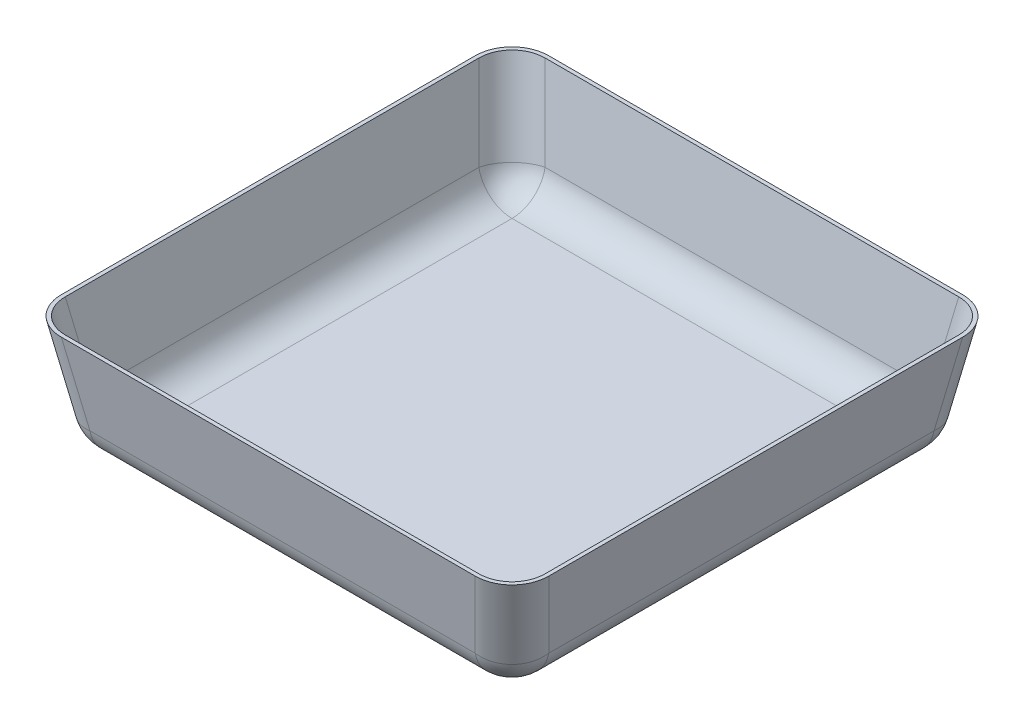
ISO-10303-21;
HEADER;
FILE_DESCRIPTION(('STEP AP214'),'2;1');
FILE_NAME('part.step','',(''),(''),'','','');
FILE_SCHEMA(('AUTOMOTIVE_DESIGN { 1 0 10303 214 1 1 1 1 }'));
ENDSEC;
DATA;
#1=APPLICATION_CONTEXT('core data for automotive mechanical design processes');
#2=APPLICATION_PROTOCOL_DEFINITION('international standard','automotive_design',2000,#1);
#3=PRODUCT_CONTEXT('',#1,'mechanical');
#4=PRODUCT('Part','Part','',(#3));
#5=PRODUCT_RELATED_PRODUCT_CATEGORY('part','',(#4));
#6=PRODUCT_DEFINITION_FORMATION('','',#4);
#7=PRODUCT_DEFINITION_CONTEXT('part definition',#1,'design');
#8=PRODUCT_DEFINITION('design','',#6,#7);
#9=PRODUCT_DEFINITION_SHAPE('','',#8);
#10=(LENGTH_UNIT() NAMED_UNIT(*) SI_UNIT(.MILLI.,.METRE.));
#11=(NAMED_UNIT(*) PLANE_ANGLE_UNIT() SI_UNIT($,.RADIAN.));
#12=(NAMED_UNIT(*) SI_UNIT($,.STERADIAN.) SOLID_ANGLE_UNIT());
#13=UNCERTAINTY_MEASURE_WITH_UNIT(LENGTH_MEASURE(1.E-05),#10,'distance_accuracy_value','');
#14=(GEOMETRIC_REPRESENTATION_CONTEXT(3) GLOBAL_UNCERTAINTY_ASSIGNED_CONTEXT((#13)) GLOBAL_UNIT_ASSIGNED_CONTEXT((#10,
#11,#12)) REPRESENTATION_CONTEXT('',''));
#15=CARTESIAN_POINT('',(0.,0.,0.));
#16=DIRECTION('',(0.,0.,1.));
#17=DIRECTION('',(1.,0.,0.));
#18=AXIS2_PLACEMENT_3D('',#15,#16,#17);
#19=CARTESIAN_POINT('',(152.4,0.,-152.4));
#20=DIRECTION('',(0.984807753012208,-0.173648177666931,0.));
#21=DIRECTION('',(0.173648177666931,0.984807753012208,0.));
#22=AXIS2_PLACEMENT_3D('',#19,#20,#21);
#23=PLANE('',#22);
#24=DIRECTION('',(0.,0.,1.));
#25=VECTOR('',#24,1.);
#26=CARTESIAN_POINT('',(165.836115929985,76.2,-152.4));
#27=LINE('',#26,#25);
#28=CARTESIAN_POINT('',(165.836115929985,76.2,140.821999003475));
#29=VERTEX_POINT('',#28);
#30=CARTESIAN_POINT('',(165.836115929985,76.2,-140.821999003475));
#31=VERTEX_POINT('',#30);
#32=EDGE_CURVE('E277',#29,#31,#27,.F.);
#33=ORIENTED_EDGE('',*,*,#32,.F.);
#34=DIRECTION('',(0.171087869746036,0.970287525247814,0.171087869746036));
#35=VECTOR('',#34,1.);
#36=CARTESIAN_POINT('',(144.21037086044,-46.4456948485988,119.19625393393));
#37=LINE('',#36,#35);
#38=CARTESIAN_POINT('',(156.100986294607,20.98933628726,131.086869368097));
#39=VERTEX_POINT('',#38);
#40=EDGE_CURVE('E57',#29,#39,#37,.F.);
#41=ORIENTED_EDGE('',*,*,#40,.T.);
#42=DIRECTION('',(0.,0.,-1.));
#43=VECTOR('',#42,1.);
#44=CARTESIAN_POINT('',(156.100986294607,20.98933628726,-152.4));
#45=LINE('',#44,#43);
#46=CARTESIAN_POINT('',(156.100986294607,20.98933628726,-131.086869368097));
#47=VERTEX_POINT('',#46);
#48=EDGE_CURVE('E319',#39,#47,#45,.T.);
#49=ORIENTED_EDGE('',*,*,#48,.T.);
#50=DIRECTION('',(0.171087869746036,0.970287525247814,-0.171087869746036));
#51=VECTOR('',#50,1.);
#52=CARTESIAN_POINT('',(153.132189696747,4.1524541156735,-128.118072770237));
#53=LINE('',#52,#51);
#54=EDGE_CURVE('E317',#47,#31,#53,.T.);
#55=ORIENTED_EDGE('',*,*,#54,.T.);
#56=EDGE_LOOP('',(#33,#41,#49,#55));
#57=FACE_BOUND('',#56,.T.);
#58=ADVANCED_FACE('F32',(#57),#23,.T.);
#59=CARTESIAN_POINT('',(-152.4,0.,-152.4));
#60=DIRECTION('',(0.,-0.173648177666931,-0.984807753012208));
#61=DIRECTION('',(0.,0.984807753012208,-0.173648177666931));
#62=AXIS2_PLACEMENT_3D('',#59,#60,#61);
#63=PLANE('',#62);
#64=DIRECTION('',(-1.,0.,0.));
#65=VECTOR('',#64,1.);
#66=CARTESIAN_POINT('',(-152.4,20.98933628726,-156.100986294607));
#67=LINE('',#66,#65);
#68=CARTESIAN_POINT('',(131.086869368097,20.98933628726,-156.100986294607));
#69=VERTEX_POINT('',#68);
#70=CARTESIAN_POINT('',(-131.086869368097,20.98933628726,-156.100986294607));
#71=VERTEX_POINT('',#70);
#72=EDGE_CURVE('E291',#69,#71,#67,.T.);
#73=ORIENTED_EDGE('',*,*,#72,.T.);
#74=DIRECTION('',(-0.171087869746036,0.970287525247814,-0.171087869746036));
#75=VECTOR('',#74,1.);
#76=CARTESIAN_POINT('',(-128.118072770237,4.1524541156735,-153.132189696747));
#77=LINE('',#76,#75);
#78=CARTESIAN_POINT('',(-140.821999003475,76.2,-165.836115929985));
#79=VERTEX_POINT('',#78);
#80=EDGE_CURVE('E294',#71,#79,#77,.T.);
#81=ORIENTED_EDGE('',*,*,#80,.T.);
#82=DIRECTION('',(1.,0.,0.));
#83=VECTOR('',#82,1.);
#84=CARTESIAN_POINT('',(-152.4,76.2,-165.836115929985));
#85=LINE('',#84,#83);
#86=CARTESIAN_POINT('',(140.821999003475,76.2,-165.836115929985));
#87=VERTEX_POINT('',#86);
#88=EDGE_CURVE('E280',#87,#79,#85,.F.);
#89=ORIENTED_EDGE('',*,*,#88,.F.);
#90=DIRECTION('',(0.171087869746036,0.970287525247814,-0.171087869746036));
#91=VECTOR('',#90,1.);
#92=CARTESIAN_POINT('',(119.19625393393,-46.4456948485988,-144.21037086044));
#93=LINE('',#92,#91);
#94=EDGE_CURVE('E289',#87,#69,#93,.F.);
#95=ORIENTED_EDGE('',*,*,#94,.T.);
#96=EDGE_LOOP('',(#73,#81,#89,#95));
#97=FACE_BOUND('',#96,.T.);
#98=ADVANCED_FACE('F380',(#97),#63,.T.);
#99=CARTESIAN_POINT('',(-152.4,0.,-152.4));
#100=DIRECTION('',(-0.984807753012208,-0.173648177666931,0.));
#101=DIRECTION('',(0.173648177666931,-0.984807753012208,0.));
#102=AXIS2_PLACEMENT_3D('',#99,#100,#101);
#103=PLANE('',#102);
#104=DIRECTION('',(0.,0.,1.));
#105=VECTOR('',#104,1.);
#106=CARTESIAN_POINT('',(-156.100986294607,20.98933628726,-152.4));
#107=LINE('',#106,#105);
#108=CARTESIAN_POINT('',(-156.100986294607,20.98933628726,-131.086869368097));
#109=VERTEX_POINT('',#108);
#110=CARTESIAN_POINT('',(-156.100986294607,20.98933628726,131.086869368097));
#111=VERTEX_POINT('',#110);
#112=EDGE_CURVE('E307',#109,#111,#107,.T.);
#113=ORIENTED_EDGE('',*,*,#112,.T.);
#114=DIRECTION('',(-0.171087869746036,0.970287525247814,0.171087869746036));
#115=VECTOR('',#114,1.);
#116=CARTESIAN_POINT('',(-144.21037086044,-46.4456948485988,119.19625393393));
#117=LINE('',#116,#115);
#118=CARTESIAN_POINT('',(-165.836115929985,76.2,140.821999003475));
#119=VERTEX_POINT('',#118);
#120=EDGE_CURVE('E309',#111,#119,#117,.T.);
#121=ORIENTED_EDGE('',*,*,#120,.T.);
#122=DIRECTION('',(0.,0.,-1.));
#123=VECTOR('',#122,1.);
#124=CARTESIAN_POINT('',(-165.836115929985,76.2,-152.4));
#125=LINE('',#124,#123);
#126=CARTESIAN_POINT('',(-165.836115929985,76.2,-140.821999003475));
#127=VERTEX_POINT('',#126);
#128=EDGE_CURVE('E283',#127,#119,#125,.F.);
#129=ORIENTED_EDGE('',*,*,#128,.F.);
#130=DIRECTION('',(-0.171087869746036,0.970287525247814,-0.171087869746036));
#131=VECTOR('',#130,1.);
#132=CARTESIAN_POINT('',(-153.132189696747,4.1524541156735,-128.118072770237));
#133=LINE('',#132,#131);
#134=EDGE_CURVE('E305',#127,#109,#133,.F.);
#135=ORIENTED_EDGE('',*,*,#134,.T.);
#136=EDGE_LOOP('',(#113,#121,#129,#135));
#137=FACE_BOUND('',#136,.T.);
#138=ADVANCED_FACE('F390',(#137),#103,.T.);
#139=CARTESIAN_POINT('',(-152.4,0.,152.4));
#140=DIRECTION('',(0.,-0.173648177666931,0.984807753012208));
#141=DIRECTION('',(0.,-0.984807753012208,-0.173648177666931));
#142=AXIS2_PLACEMENT_3D('',#139,#140,#141);
#143=PLANE('',#142);
#144=DIRECTION('',(-1.,0.,0.));
#145=VECTOR('',#144,1.);
#146=CARTESIAN_POINT('',(-152.4,76.2,165.836115929985));
#147=LINE('',#146,#145);
#148=CARTESIAN_POINT('',(-140.821999003475,76.2,165.836115929985));
#149=VERTEX_POINT('',#148);
#150=CARTESIAN_POINT('',(140.821999003475,76.2,165.836115929985));
#151=VERTEX_POINT('',#150);
#152=EDGE_CURVE('E286',#149,#151,#147,.F.);
#153=ORIENTED_EDGE('',*,*,#152,.F.);
#154=DIRECTION('',(-0.171087869746036,0.970287525247814,0.171087869746036));
#155=VECTOR('',#154,1.);
#156=CARTESIAN_POINT('',(-128.118072770237,4.15245411567349,153.132189696747));
#157=LINE('',#156,#155);
#158=CARTESIAN_POINT('',(-131.086869368097,20.98933628726,156.100986294607));
#159=VERTEX_POINT('',#158);
#160=EDGE_CURVE('E315',#149,#159,#157,.F.);
#161=ORIENTED_EDGE('',*,*,#160,.T.);
#162=DIRECTION('',(1.,0.,0.));
#163=VECTOR('',#162,1.);
#164=CARTESIAN_POINT('',(-152.4,20.98933628726,156.100986294607));
#165=LINE('',#164,#163);
#166=CARTESIAN_POINT('',(131.086869368097,20.98933628726,156.100986294607));
#167=VERTEX_POINT('',#166);
#168=EDGE_CURVE('E313',#159,#167,#165,.T.);
#169=ORIENTED_EDGE('',*,*,#168,.T.);
#170=DIRECTION('',(0.171087869746036,0.970287525247814,0.171087869746036));
#171=VECTOR('',#170,1.);
#172=CARTESIAN_POINT('',(119.19625393393,-46.4456948485988,144.21037086044));
#173=LINE('',#172,#171);
#174=EDGE_CURVE('E311',#167,#151,#173,.T.);
#175=ORIENTED_EDGE('',*,*,#174,.T.);
#176=EDGE_LOOP('',(#153,#161,#169,#175));
#177=FACE_BOUND('',#176,.T.);
#178=ADVANCED_FACE('F412',(#177),#143,.T.);
#179=CARTESIAN_POINT('',(0.,76.2,0.));
#180=DIRECTION('',(0.,1.,0.));
#181=DIRECTION('',(0.,0.,1.));
#182=AXIS2_PLACEMENT_3D('',#179,#180,#181);
#183=PLANE('',#182);
#184=DIRECTION('',(0.,0.,-1.));
#185=VECTOR('',#184,1.);
#186=CARTESIAN_POINT('',(-163.256932335795,76.2,-152.4));
#187=LINE('',#186,#185);
#188=CARTESIAN_POINT('',(-163.256932335795,76.2,-140.744227101936));
#189=VERTEX_POINT('',#188);
#190=CARTESIAN_POINT('',(-163.256932335795,76.2,140.744227101936));
#191=VERTEX_POINT('',#190);
#192=EDGE_CURVE('E266',#189,#191,#187,.F.);
#193=ORIENTED_EDGE('',*,*,#192,.F.);
#194=CARTESIAN_POINT('',(-140.044279988087,76.2,-140.044279988087));
#195=DIRECTION('',(0.,1.,0.));
#196=DIRECTION('',(0.707106781186548,0.,0.707106781186547));
#197=AXIS2_PLACEMENT_3D('',#194,#195,#196);
#198=ELLIPSE('',#197,23.5600266984382,22.86);
#199=CARTESIAN_POINT('',(-140.744227101936,76.2,-163.256932335795));
#200=VERTEX_POINT('',#199);
#201=EDGE_CURVE('E267',#200,#189,#198,.T.);
#202=ORIENTED_EDGE('',*,*,#201,.F.);
#203=DIRECTION('',(1.,0.,0.));
#204=VECTOR('',#203,1.);
#205=CARTESIAN_POINT('',(-152.4,76.2,-163.256932335795));
#206=LINE('',#205,#204);
#207=CARTESIAN_POINT('',(140.744227101936,76.2,-163.256932335795));
#208=VERTEX_POINT('',#207);
#209=EDGE_CURVE('E49',#208,#200,#206,.F.);
#210=ORIENTED_EDGE('',*,*,#209,.F.);
#211=CARTESIAN_POINT('',(140.044279988087,76.2,-140.044279988087));
#212=DIRECTION('',(0.,1.,0.));
#213=DIRECTION('',(-0.707106781186547,0.,0.707106781186548));
#214=AXIS2_PLACEMENT_3D('',#211,#212,#213);
#215=ELLIPSE('',#214,23.5600266984382,22.86);
#216=CARTESIAN_POINT('',(163.256932335795,76.2,-140.744227101936));
#217=VERTEX_POINT('',#216);
#218=EDGE_CURVE('E183',#217,#208,#215,.T.);
#219=ORIENTED_EDGE('',*,*,#218,.F.);
#220=DIRECTION('',(0.,0.,1.));
#221=VECTOR('',#220,1.);
#222=CARTESIAN_POINT('',(163.256932335795,76.2,-152.4));
#223=LINE('',#222,#221);
#224=CARTESIAN_POINT('',(163.256932335795,76.2,140.744227101936));
#225=VERTEX_POINT('',#224);
#226=EDGE_CURVE('E240',#225,#217,#223,.F.);
#227=ORIENTED_EDGE('',*,*,#226,.F.);
#228=CARTESIAN_POINT('',(140.044279988087,76.2,140.044279988087));
#229=DIRECTION('',(0.,1.,0.));
#230=DIRECTION('',(-0.707106781186547,0.,-0.707106781186548));
#231=AXIS2_PLACEMENT_3D('',#228,#229,#230);
#232=ELLIPSE('',#231,23.5600266984382,22.86);
#233=CARTESIAN_POINT('',(140.744227101936,76.2,163.256932335795));
#234=VERTEX_POINT('',#233);
#235=EDGE_CURVE('E178',#234,#225,#232,.T.);
#236=ORIENTED_EDGE('',*,*,#235,.F.);
#237=DIRECTION('',(-1.,0.,0.));
#238=VECTOR('',#237,1.);
#239=CARTESIAN_POINT('',(-152.4,76.2,163.256932335795));
#240=LINE('',#239,#238);
#241=CARTESIAN_POINT('',(-140.744227101936,76.2,163.256932335795));
#242=VERTEX_POINT('',#241);
#243=EDGE_CURVE('E250',#242,#234,#240,.F.);
#244=ORIENTED_EDGE('',*,*,#243,.F.);
#245=CARTESIAN_POINT('',(-140.044279988087,76.2,140.044279988087));
#246=DIRECTION('',(0.,1.,0.));
#247=DIRECTION('',(0.707106781186548,0.,-0.707106781186547));
#248=AXIS2_PLACEMENT_3D('',#245,#246,#247);
#249=ELLIPSE('',#248,23.5600266984382,22.86);
#250=EDGE_CURVE('E269',#191,#242,#249,.T.);
#251=ORIENTED_EDGE('',*,*,#250,.F.);
#252=EDGE_LOOP('',(#193,#202,#210,#219,#227,#236,#244,#251));
#253=FACE_BOUND('',#252,.T.);
#254=ORIENTED_EDGE('',*,*,#128,.T.);
#255=CARTESIAN_POINT('',(-140.044279988087,76.2,140.044279988087));
#256=DIRECTION('',(0.,1.,0.));
#257=DIRECTION('',(0.707106781186548,0.,-0.707106781186547));
#258=AXIS2_PLACEMENT_3D('',#255,#256,#257);
#259=ELLIPSE('',#258,26.1778074427091,25.4);
#260=EDGE_CURVE('E11',#119,#149,#259,.T.);
#261=ORIENTED_EDGE('',*,*,#260,.T.);
#262=ORIENTED_EDGE('',*,*,#152,.T.);
#263=CARTESIAN_POINT('',(140.044279988087,76.2,140.044279988087));
#264=DIRECTION('',(0.,1.,0.));
#265=DIRECTION('',(-0.707106781186547,0.,-0.707106781186548));
#266=AXIS2_PLACEMENT_3D('',#263,#264,#265);
#267=ELLIPSE('',#266,26.1778074427091,25.4);
#268=EDGE_CURVE('E324',#151,#29,#267,.T.);
#269=ORIENTED_EDGE('',*,*,#268,.T.);
#270=ORIENTED_EDGE('',*,*,#32,.T.);
#271=CARTESIAN_POINT('',(140.044279988087,76.2,-140.044279988087));
#272=DIRECTION('',(0.,1.,0.));
#273=DIRECTION('',(-0.707106781186547,0.,0.707106781186548));
#274=AXIS2_PLACEMENT_3D('',#271,#272,#273);
#275=ELLIPSE('',#274,26.1778074427091,25.4);
#276=EDGE_CURVE('E322',#31,#87,#275,.T.);
#277=ORIENTED_EDGE('',*,*,#276,.T.);
#278=ORIENTED_EDGE('',*,*,#88,.T.);
#279=CARTESIAN_POINT('',(-140.044279988087,76.2,-140.044279988087));
#280=DIRECTION('',(0.,1.,0.));
#281=DIRECTION('',(0.707106781186548,0.,0.707106781186547));
#282=AXIS2_PLACEMENT_3D('',#279,#280,#281);
#283=ELLIPSE('',#282,26.1778074427091,25.4);
#284=EDGE_CURVE('E41',#79,#127,#283,.T.);
#285=ORIENTED_EDGE('',*,*,#284,.T.);
#286=EDGE_LOOP('',(#254,#261,#262,#269,#270,#277,#278,#285));
#287=FACE_BOUND('',#286,.T.);
#288=ADVANCED_FACE('F377',(#253,#287),#183,.T.);
#289=CARTESIAN_POINT('',(0.,0.,0.));
#290=DIRECTION('',(0.,1.,0.));
#291=DIRECTION('',(0.,0.,1.));
#292=AXIS2_PLACEMENT_3D('',#289,#290,#291);
#293=PLANE('',#292);
#294=DIRECTION('',(0.,0.,-1.));
#295=VECTOR('',#294,1.);
#296=CARTESIAN_POINT('',(-131.086869368097,0.,0.));
#297=LINE('',#296,#295);
#298=CARTESIAN_POINT('',(-131.086869368097,0.,131.086869368097));
#299=VERTEX_POINT('',#298);
#300=CARTESIAN_POINT('',(-131.086869368097,0.,-131.086869368097));
#301=VERTEX_POINT('',#300);
#302=EDGE_CURVE('E300',#299,#301,#297,.T.);
#303=ORIENTED_EDGE('',*,*,#302,.T.);
#304=DIRECTION('',(1.,0.,0.));
#305=VECTOR('',#304,1.);
#306=CARTESIAN_POINT('',(0.,0.,-131.086869368097));
#307=LINE('',#306,#305);
#308=CARTESIAN_POINT('',(131.086869368097,0.,-131.086869368097));
#309=VERTEX_POINT('',#308);
#310=EDGE_CURVE('E302',#301,#309,#307,.T.);
#311=ORIENTED_EDGE('',*,*,#310,.T.);
#312=DIRECTION('',(0.,0.,1.));
#313=VECTOR('',#312,1.);
#314=CARTESIAN_POINT('',(131.086869368097,0.,0.));
#315=LINE('',#314,#313);
#316=CARTESIAN_POINT('',(131.086869368097,0.,131.086869368097));
#317=VERTEX_POINT('',#316);
#318=EDGE_CURVE('E296',#309,#317,#315,.T.);
#319=ORIENTED_EDGE('',*,*,#318,.T.);
#320=DIRECTION('',(-1.,0.,0.));
#321=VECTOR('',#320,1.);
#322=CARTESIAN_POINT('',(0.,0.,131.086869368097));
#323=LINE('',#322,#321);
#324=EDGE_CURVE('E298',#317,#299,#323,.T.);
#325=ORIENTED_EDGE('',*,*,#324,.T.);
#326=EDGE_LOOP('',(#303,#311,#319,#325));
#327=FACE_BOUND('',#326,.T.);
#328=ADVANCED_FACE('F407',(#327),#293,.F.);
#329=CARTESIAN_POINT('',(119.19625393393,-42.0350311358588,119.19625393393));
#330=DIRECTION('',(-0.171087869746036,-0.970287525247814,-0.171087869746036));
#331=DIRECTION('',(0.,0.173648177666931,-0.984807753012208));
#332=AXIS2_PLACEMENT_3D('',#329,#330,#331);
#333=CYLINDRICAL_SURFACE('',#332,25.4);
#334=ORIENTED_EDGE('',*,*,#268,.F.);
#335=ORIENTED_EDGE('',*,*,#174,.F.);
#336=CARTESIAN_POINT('',(131.086869368097,25.4,131.086869368097));
#337=DIRECTION('',(-0.171087869746036,-0.970287525247814,-0.171087869746036));
#338=DIRECTION('',(0.,0.173648177666931,-0.984807753012208));
#339=AXIS2_PLACEMENT_3D('',#336,#337,#338);
#340=CIRCLE('',#339,25.4);
#341=EDGE_CURVE('E353',#39,#167,#340,.T.);
#342=ORIENTED_EDGE('',*,*,#341,.F.);
#343=ORIENTED_EDGE('',*,*,#40,.F.);
#344=EDGE_LOOP('',(#334,#335,#342,#343));
#345=FACE_BOUND('',#344,.T.);
#346=ADVANCED_FACE('F34',(#345),#333,.T.);
#347=CARTESIAN_POINT('',(-128.118072770237,8.56311782841353,128.118072770237));
#348=DIRECTION('',(0.171087869746036,-0.970287525247814,-0.171087869746036));
#349=DIRECTION('',(0.984807753012208,0.173648177666931,0.));
#350=AXIS2_PLACEMENT_3D('',#347,#348,#349);
#351=CYLINDRICAL_SURFACE('',#350,25.4);
#352=ORIENTED_EDGE('',*,*,#260,.F.);
#353=ORIENTED_EDGE('',*,*,#120,.F.);
#354=CARTESIAN_POINT('',(-131.086869368097,25.4,131.086869368097));
#355=DIRECTION('',(0.171087869746036,-0.970287525247814,-0.171087869746036));
#356=DIRECTION('',(0.984807753012208,0.173648177666931,0.));
#357=AXIS2_PLACEMENT_3D('',#354,#355,#356);
#358=CIRCLE('',#357,25.4);
#359=EDGE_CURVE('E351',#159,#111,#358,.T.);
#360=ORIENTED_EDGE('',*,*,#359,.F.);
#361=ORIENTED_EDGE('',*,*,#160,.F.);
#362=EDGE_LOOP('',(#352,#353,#360,#361));
#363=FACE_BOUND('',#362,.T.);
#364=ADVANCED_FACE('F395',(#363),#351,.T.);
#365=CARTESIAN_POINT('',(-152.4,25.4,131.086869368097));
#366=DIRECTION('',(-1.,0.,0.));
#367=DIRECTION('',(0.,0.,1.));
#368=AXIS2_PLACEMENT_3D('',#365,#366,#367);
#369=CYLINDRICAL_SURFACE('',#368,25.4);
#370=CARTESIAN_POINT('',(131.086869368097,25.4,131.086869368097));
#371=DIRECTION('',(1.,0.,0.));
#372=DIRECTION('',(0.,0.,-1.));
#373=AXIS2_PLACEMENT_3D('',#370,#371,#372);
#374=CIRCLE('',#373,25.4);
#375=EDGE_CURVE('E36',#167,#317,#374,.T.);
#376=ORIENTED_EDGE('',*,*,#375,.F.);
#377=ORIENTED_EDGE('',*,*,#168,.F.);
#378=CARTESIAN_POINT('',(-131.086869368097,25.4,131.086869368097));
#379=DIRECTION('',(-1.,0.,0.));
#380=DIRECTION('',(0.,0.,1.));
#381=AXIS2_PLACEMENT_3D('',#378,#379,#380);
#382=CIRCLE('',#381,25.4);
#383=EDGE_CURVE('E348',#299,#159,#382,.T.);
#384=ORIENTED_EDGE('',*,*,#383,.F.);
#385=ORIENTED_EDGE('',*,*,#324,.F.);
#386=EDGE_LOOP('',(#376,#377,#384,#385));
#387=FACE_BOUND('',#386,.T.);
#388=ADVANCED_FACE('F408',(#387),#369,.T.);
#389=CARTESIAN_POINT('',(131.086869368097,25.4,131.086869368097));
#390=DIRECTION('',(0.,0.,1.));
#391=DIRECTION('',(1.,0.,0.));
#392=AXIS2_PLACEMENT_3D('',#389,#390,#391);
#393=SPHERICAL_SURFACE('',#392,25.4);
#394=ORIENTED_EDGE('',*,*,#341,.T.);
#395=ORIENTED_EDGE('',*,*,#375,.T.);
#396=CARTESIAN_POINT('',(131.086869368097,25.4,131.086869368097));
#397=DIRECTION('',(0.,0.,1.));
#398=DIRECTION('',(1.,0.,0.));
#399=AXIS2_PLACEMENT_3D('',#396,#397,#398);
#400=CIRCLE('',#399,25.4);
#401=EDGE_CURVE('E345',#39,#317,#400,.F.);
#402=ORIENTED_EDGE('',*,*,#401,.F.);
#403=EDGE_LOOP('',(#394,#395,#402));
#404=FACE_BOUND('',#403,.T.);
#405=ADVANCED_FACE('F359',(#404),#393,.T.);
#406=CARTESIAN_POINT('',(-131.086869368097,25.4,131.086869368097));
#407=DIRECTION('',(0.,0.,1.));
#408=DIRECTION('',(1.,0.,0.));
#409=AXIS2_PLACEMENT_3D('',#406,#407,#408);
#410=SPHERICAL_SURFACE('',#409,25.4);
#411=ORIENTED_EDGE('',*,*,#383,.T.);
#412=ORIENTED_EDGE('',*,*,#359,.T.);
#413=CARTESIAN_POINT('',(-131.086869368097,25.4,131.086869368097));
#414=DIRECTION('',(0.,0.,1.));
#415=DIRECTION('',(1.,0.,0.));
#416=AXIS2_PLACEMENT_3D('',#413,#414,#415);
#417=CIRCLE('',#416,25.4);
#418=EDGE_CURVE('E342',#299,#111,#417,.F.);
#419=ORIENTED_EDGE('',*,*,#418,.F.);
#420=EDGE_LOOP('',(#411,#412,#419));
#421=FACE_BOUND('',#420,.T.);
#422=ADVANCED_FACE('F399',(#421),#410,.T.);
#423=CARTESIAN_POINT('',(131.086869368097,25.4,-152.4));
#424=DIRECTION('',(0.,0.,1.));
#425=DIRECTION('',(1.,0.,0.));
#426=AXIS2_PLACEMENT_3D('',#423,#424,#425);
#427=CYLINDRICAL_SURFACE('',#426,25.4);
#428=ORIENTED_EDGE('',*,*,#401,.T.);
#429=ORIENTED_EDGE('',*,*,#318,.F.);
#430=CARTESIAN_POINT('',(131.086869368097,25.4,-131.086869368097));
#431=DIRECTION('',(0.,0.,-1.));
#432=DIRECTION('',(-1.,0.,0.));
#433=AXIS2_PLACEMENT_3D('',#430,#431,#432);
#434=CIRCLE('',#433,25.4);
#435=EDGE_CURVE('E339',#47,#309,#434,.T.);
#436=ORIENTED_EDGE('',*,*,#435,.F.);
#437=ORIENTED_EDGE('',*,*,#48,.F.);
#438=EDGE_LOOP('',(#428,#429,#436,#437));
#439=FACE_BOUND('',#438,.T.);
#440=ADVANCED_FACE('F366',(#439),#427,.T.);
#441=CARTESIAN_POINT('',(119.19625393393,-42.0350311358588,-119.19625393393));
#442=DIRECTION('',(-0.171087869746036,-0.970287525247814,0.171087869746036));
#443=DIRECTION('',(0.,-0.173648177666931,-0.984807753012208));
#444=AXIS2_PLACEMENT_3D('',#441,#442,#443);
#445=CYLINDRICAL_SURFACE('',#444,25.4);
#446=ORIENTED_EDGE('',*,*,#276,.F.);
#447=ORIENTED_EDGE('',*,*,#54,.F.);
#448=CARTESIAN_POINT('',(131.086869368097,25.4,-131.086869368097));
#449=DIRECTION('',(-0.171087869746036,-0.970287525247814,0.171087869746036));
#450=DIRECTION('',(0.984807753012208,-0.173648177666931,0.));
#451=AXIS2_PLACEMENT_3D('',#448,#449,#450);
#452=CIRCLE('',#451,25.4);
#453=EDGE_CURVE('E336',#69,#47,#452,.T.);
#454=ORIENTED_EDGE('',*,*,#453,.F.);
#455=ORIENTED_EDGE('',*,*,#94,.F.);
#456=EDGE_LOOP('',(#446,#447,#454,#455));
#457=FACE_BOUND('',#456,.T.);
#458=ADVANCED_FACE('F372',(#457),#445,.T.);
#459=CARTESIAN_POINT('',(-128.118072770237,8.56311782841354,-128.118072770237));
#460=DIRECTION('',(0.171087869746036,-0.970287525247814,0.171087869746036));
#461=DIRECTION('',(0.984807753012208,0.173648177666931,0.));
#462=AXIS2_PLACEMENT_3D('',#459,#460,#461);
#463=CYLINDRICAL_SURFACE('',#462,25.4);
#464=ORIENTED_EDGE('',*,*,#284,.F.);
#465=ORIENTED_EDGE('',*,*,#80,.F.);
#466=CARTESIAN_POINT('',(-131.086869368097,25.4,-131.086869368097));
#467=DIRECTION('',(0.171087869746036,-0.970287525247814,0.171087869746035));
#468=DIRECTION('',(0.984807753012208,0.173648177666931,0.));
#469=AXIS2_PLACEMENT_3D('',#466,#467,#468);
#470=CIRCLE('',#469,25.4);
#471=EDGE_CURVE('E333',#109,#71,#470,.T.);
#472=ORIENTED_EDGE('',*,*,#471,.F.);
#473=ORIENTED_EDGE('',*,*,#134,.F.);
#474=EDGE_LOOP('',(#464,#465,#472,#473));
#475=FACE_BOUND('',#474,.T.);
#476=ADVANCED_FACE('F385',(#475),#463,.T.);
#477=CARTESIAN_POINT('',(-131.086869368097,25.4,-152.4));
#478=DIRECTION('',(0.,0.,-1.));
#479=DIRECTION('',(-1.,0.,0.));
#480=AXIS2_PLACEMENT_3D('',#477,#478,#479);
#481=CYLINDRICAL_SURFACE('',#480,25.4);
#482=ORIENTED_EDGE('',*,*,#418,.T.);
#483=ORIENTED_EDGE('',*,*,#112,.F.);
#484=CARTESIAN_POINT('',(-131.086869368097,25.4,-131.086869368097));
#485=DIRECTION('',(0.,0.,-1.));
#486=DIRECTION('',(-1.,0.,0.));
#487=AXIS2_PLACEMENT_3D('',#484,#485,#486);
#488=CIRCLE('',#487,25.4);
#489=EDGE_CURVE('E330',#301,#109,#488,.T.);
#490=ORIENTED_EDGE('',*,*,#489,.F.);
#491=ORIENTED_EDGE('',*,*,#302,.F.);
#492=EDGE_LOOP('',(#482,#483,#490,#491));
#493=FACE_BOUND('',#492,.T.);
#494=ADVANCED_FACE('F403',(#493),#481,.T.);
#495=CARTESIAN_POINT('',(131.086869368097,25.4,-131.086869368097));
#496=DIRECTION('',(0.,0.,1.));
#497=DIRECTION('',(1.,0.,0.));
#498=AXIS2_PLACEMENT_3D('',#495,#496,#497);
#499=SPHERICAL_SURFACE('',#498,25.4);
#500=ORIENTED_EDGE('',*,*,#453,.T.);
#501=ORIENTED_EDGE('',*,*,#435,.T.);
#502=CARTESIAN_POINT('',(131.086869368097,25.4,-131.086869368097));
#503=DIRECTION('',(1.,0.,0.));
#504=DIRECTION('',(0.,0.,-1.));
#505=AXIS2_PLACEMENT_3D('',#502,#503,#504);
#506=CIRCLE('',#505,25.4);
#507=EDGE_CURVE('E328',#69,#309,#506,.F.);
#508=ORIENTED_EDGE('',*,*,#507,.F.);
#509=EDGE_LOOP('',(#500,#501,#508));
#510=FACE_BOUND('',#509,.T.);
#511=ADVANCED_FACE('F440',(#510),#499,.T.);
#512=CARTESIAN_POINT('',(-131.086869368097,25.4,-131.086869368097));
#513=DIRECTION('',(0.,0.,1.));
#514=DIRECTION('',(1.,0.,0.));
#515=AXIS2_PLACEMENT_3D('',#512,#513,#514);
#516=SPHERICAL_SURFACE('',#515,25.4);
#517=ORIENTED_EDGE('',*,*,#489,.T.);
#518=ORIENTED_EDGE('',*,*,#471,.T.);
#519=CARTESIAN_POINT('',(-131.086869368097,25.4,-131.086869368097));
#520=DIRECTION('',(-1.,0.,0.));
#521=DIRECTION('',(0.,0.,1.));
#522=AXIS2_PLACEMENT_3D('',#519,#520,#521);
#523=CIRCLE('',#522,25.4);
#524=EDGE_CURVE('E273',#301,#71,#523,.F.);
#525=ORIENTED_EDGE('',*,*,#524,.F.);
#526=EDGE_LOOP('',(#517,#518,#525));
#527=FACE_BOUND('',#526,.T.);
#528=ADVANCED_FACE('F436',(#527),#516,.T.);
#529=CARTESIAN_POINT('',(-152.4,25.4,-131.086869368097));
#530=DIRECTION('',(1.,0.,0.));
#531=DIRECTION('',(0.,0.,-1.));
#532=AXIS2_PLACEMENT_3D('',#529,#530,#531);
#533=CYLINDRICAL_SURFACE('',#532,25.4);
#534=ORIENTED_EDGE('',*,*,#507,.T.);
#535=ORIENTED_EDGE('',*,*,#310,.F.);
#536=ORIENTED_EDGE('',*,*,#524,.T.);
#537=ORIENTED_EDGE('',*,*,#72,.F.);
#538=EDGE_LOOP('',(#534,#535,#536,#537));
#539=FACE_BOUND('',#538,.T.);
#540=ADVANCED_FACE('F433',(#539),#533,.T.);
#541=CARTESIAN_POINT('',(149.898588307349,0.441066371274004,-152.4));
#542=DIRECTION('',(0.984807753012208,-0.173648177666931,0.));
#543=DIRECTION('',(0.173648177666931,0.984807753012208,0.));
#544=AXIS2_PLACEMENT_3D('',#541,#542,#543);
#545=PLANE('',#544);
#546=ORIENTED_EDGE('',*,*,#226,.T.);
#547=DIRECTION('',(-0.171087869746036,-0.970287525247814,0.171087869746036));
#548=VECTOR('',#547,1.);
#549=CARTESIAN_POINT('',(141.708959167789,-46.0046284773248,-119.19625393393));
#550=LINE('',#549,#548);
#551=CARTESIAN_POINT('',(153.599574601956,21.430402658534,-131.086869368097));
#552=VERTEX_POINT('',#551);
#553=EDGE_CURVE('E207',#552,#217,#550,.F.);
#554=ORIENTED_EDGE('',*,*,#553,.F.);
#555=DIRECTION('',(0.,0.,1.));
#556=VECTOR('',#555,1.);
#557=CARTESIAN_POINT('',(153.599574601956,21.430402658534,-152.4));
#558=LINE('',#557,#556);
#559=CARTESIAN_POINT('',(153.599574601956,21.430402658534,131.086869368097));
#560=VERTEX_POINT('',#559);
#561=EDGE_CURVE('E184',#560,#552,#558,.F.);
#562=ORIENTED_EDGE('',*,*,#561,.F.);
#563=DIRECTION('',(-0.171087869746036,-0.970287525247814,-0.171087869746036));
#564=VECTOR('',#563,1.);
#565=CARTESIAN_POINT('',(141.708959167789,-46.0046284773248,119.19625393393));
#566=LINE('',#565,#564);
#567=EDGE_CURVE('E173',#225,#560,#566,.T.);
#568=ORIENTED_EDGE('',*,*,#567,.F.);
#569=EDGE_LOOP('',(#546,#554,#562,#568));
#570=FACE_BOUND('',#569,.T.);
#571=ADVANCED_FACE('F206',(#570),#545,.F.);
#572=CARTESIAN_POINT('',(-152.4,0.441066371274004,-149.898588307349));
#573=DIRECTION('',(0.,-0.173648177666931,-0.984807753012208));
#574=DIRECTION('',(0.,0.984807753012208,-0.173648177666931));
#575=AXIS2_PLACEMENT_3D('',#572,#573,#574);
#576=PLANE('',#575);
#577=DIRECTION('',(1.,0.,0.));
#578=VECTOR('',#577,1.);
#579=CARTESIAN_POINT('',(-152.4,21.430402658534,-153.599574601956));
#580=LINE('',#579,#578);
#581=CARTESIAN_POINT('',(131.086869368097,21.430402658534,-153.599574601956));
#582=VERTEX_POINT('',#581);
#583=CARTESIAN_POINT('',(-131.086869368097,21.4304026585339,-153.599574601956));
#584=VERTEX_POINT('',#583);
#585=EDGE_CURVE('E249',#582,#584,#580,.F.);
#586=ORIENTED_EDGE('',*,*,#585,.F.);
#587=DIRECTION('',(0.171087869746036,0.970287525247814,-0.171087869746036));
#588=VECTOR('',#587,1.);
#589=CARTESIAN_POINT('',(119.19625393393,-46.0046284773248,-141.708959167789));
#590=LINE('',#589,#588);
#591=EDGE_CURVE('E247',#208,#582,#590,.F.);
#592=ORIENTED_EDGE('',*,*,#591,.F.);
#593=ORIENTED_EDGE('',*,*,#209,.T.);
#594=DIRECTION('',(0.171087869746036,-0.970287525247814,0.171087869746036));
#595=VECTOR('',#594,1.);
#596=CARTESIAN_POINT('',(-128.118072770237,4.5935204869475,-150.630778004096));
#597=LINE('',#596,#595);
#598=EDGE_CURVE('E238',#584,#200,#597,.F.);
#599=ORIENTED_EDGE('',*,*,#598,.F.);
#600=EDGE_LOOP('',(#586,#592,#593,#599));
#601=FACE_BOUND('',#600,.T.);
#602=ADVANCED_FACE('F505',(#601),#576,.F.);
#603=CARTESIAN_POINT('',(-149.898588307349,0.441066371274004,-152.4));
#604=DIRECTION('',(-0.984807753012208,-0.173648177666931,0.));
#605=DIRECTION('',(0.173648177666931,-0.984807753012208,0.));
#606=AXIS2_PLACEMENT_3D('',#603,#604,#605);
#607=PLANE('',#606);
#608=DIRECTION('',(0.,0.,1.));
#609=VECTOR('',#608,1.);
#610=CARTESIAN_POINT('',(-153.599574601956,21.430402658534,-152.4));
#611=LINE('',#610,#609);
#612=CARTESIAN_POINT('',(-153.599574601956,21.430402658534,-131.086869368097));
#613=VERTEX_POINT('',#612);
#614=CARTESIAN_POINT('',(-153.599574601956,21.430402658534,131.086869368097));
#615=VERTEX_POINT('',#614);
#616=EDGE_CURVE('E220',#613,#615,#611,.T.);
#617=ORIENTED_EDGE('',*,*,#616,.F.);
#618=DIRECTION('',(0.171087869746036,-0.970287525247814,0.171087869746036));
#619=VECTOR('',#618,1.);
#620=CARTESIAN_POINT('',(-150.630778004096,4.5935204869475,-128.118072770237));
#621=LINE('',#620,#619);
#622=EDGE_CURVE('E224',#189,#613,#621,.T.);
#623=ORIENTED_EDGE('',*,*,#622,.F.);
#624=ORIENTED_EDGE('',*,*,#192,.T.);
#625=DIRECTION('',(0.171087869746036,-0.970287525247814,-0.171087869746036));
#626=VECTOR('',#625,1.);
#627=CARTESIAN_POINT('',(-150.630778004096,4.59352048694749,128.118072770237));
#628=LINE('',#627,#626);
#629=EDGE_CURVE('E215',#615,#191,#628,.F.);
#630=ORIENTED_EDGE('',*,*,#629,.F.);
#631=EDGE_LOOP('',(#617,#623,#624,#630));
#632=FACE_BOUND('',#631,.T.);
#633=ADVANCED_FACE('F512',(#632),#607,.F.);
#634=CARTESIAN_POINT('',(-152.4,0.441066371274004,149.898588307349));
#635=DIRECTION('',(0.,-0.173648177666931,0.984807753012208));
#636=DIRECTION('',(0.,-0.984807753012208,-0.173648177666931));
#637=AXIS2_PLACEMENT_3D('',#634,#635,#636);
#638=PLANE('',#637);
#639=ORIENTED_EDGE('',*,*,#243,.T.);
#640=DIRECTION('',(-0.171087869746036,-0.970287525247814,-0.171087869746036));
#641=VECTOR('',#640,1.);
#642=CARTESIAN_POINT('',(119.19625393393,-46.0046284773248,141.708959167789));
#643=LINE('',#642,#641);
#644=CARTESIAN_POINT('',(131.086869368097,21.430402658534,153.599574601956));
#645=VERTEX_POINT('',#644);
#646=EDGE_CURVE('E213',#645,#234,#643,.F.);
#647=ORIENTED_EDGE('',*,*,#646,.F.);
#648=DIRECTION('',(1.,0.,0.));
#649=VECTOR('',#648,1.);
#650=CARTESIAN_POINT('',(-152.4,21.430402658534,153.599574601956));
#651=LINE('',#650,#649);
#652=CARTESIAN_POINT('',(-131.086869368097,21.430402658534,153.599574601956));
#653=VERTEX_POINT('',#652);
#654=EDGE_CURVE('E214',#653,#645,#651,.T.);
#655=ORIENTED_EDGE('',*,*,#654,.F.);
#656=DIRECTION('',(0.171087869746036,-0.970287525247814,-0.171087869746036));
#657=VECTOR('',#656,1.);
#658=CARTESIAN_POINT('',(-128.118072770237,4.5935204869475,150.630778004096));
#659=LINE('',#658,#657);
#660=EDGE_CURVE('E210',#242,#653,#659,.T.);
#661=ORIENTED_EDGE('',*,*,#660,.F.);
#662=EDGE_LOOP('',(#639,#647,#655,#661));
#663=FACE_BOUND('',#662,.T.);
#664=ADVANCED_FACE('F519',(#663),#638,.F.);
#665=CARTESIAN_POINT('',(0.,2.54,0.));
#666=DIRECTION('',(0.,1.,0.));
#667=DIRECTION('',(0.,0.,1.));
#668=AXIS2_PLACEMENT_3D('',#665,#666,#667);
#669=PLANE('',#668);
#670=DIRECTION('',(0.,0.,1.));
#671=VECTOR('',#670,1.);
#672=CARTESIAN_POINT('',(-131.086869368097,2.54,0.));
#673=LINE('',#672,#671);
#674=CARTESIAN_POINT('',(-131.086869368097,2.54,131.086869368097));
#675=VERTEX_POINT('',#674);
#676=CARTESIAN_POINT('',(-131.086869368097,2.54,-131.086869368097));
#677=VERTEX_POINT('',#676);
#678=EDGE_CURVE('E232',#675,#677,#673,.F.);
#679=ORIENTED_EDGE('',*,*,#678,.F.);
#680=DIRECTION('',(1.,0.,0.));
#681=VECTOR('',#680,1.);
#682=CARTESIAN_POINT('',(0.,2.54,131.086869368097));
#683=LINE('',#682,#681);
#684=CARTESIAN_POINT('',(131.086869368097,2.54,131.086869368097));
#685=VERTEX_POINT('',#684);
#686=EDGE_CURVE('E234',#685,#675,#683,.F.);
#687=ORIENTED_EDGE('',*,*,#686,.F.);
#688=DIRECTION('',(0.,0.,1.));
#689=VECTOR('',#688,1.);
#690=CARTESIAN_POINT('',(131.086869368097,2.54,0.));
#691=LINE('',#690,#689);
#692=CARTESIAN_POINT('',(131.086869368097,2.54,-131.086869368097));
#693=VERTEX_POINT('',#692);
#694=EDGE_CURVE('E201',#693,#685,#691,.T.);
#695=ORIENTED_EDGE('',*,*,#694,.F.);
#696=DIRECTION('',(1.,0.,0.));
#697=VECTOR('',#696,1.);
#698=CARTESIAN_POINT('',(0.,2.54,-131.086869368097));
#699=LINE('',#698,#697);
#700=EDGE_CURVE('E226',#677,#693,#699,.T.);
#701=ORIENTED_EDGE('',*,*,#700,.F.);
#702=EDGE_LOOP('',(#679,#687,#695,#701));
#703=FACE_BOUND('',#702,.T.);
#704=ADVANCED_FACE('F527',(#703),#669,.T.);
#705=CARTESIAN_POINT('',(119.19625393393,-42.0350311358588,119.19625393393));
#706=DIRECTION('',(-0.171087869746036,-0.970287525247814,-0.171087869746036));
#707=DIRECTION('',(0.,0.173648177666931,-0.984807753012208));
#708=AXIS2_PLACEMENT_3D('',#705,#706,#707);
#709=CYLINDRICAL_SURFACE('',#708,22.86);
#710=ORIENTED_EDGE('',*,*,#235,.T.);
#711=ORIENTED_EDGE('',*,*,#567,.T.);
#712=CARTESIAN_POINT('',(131.086869368097,25.4,131.086869368097));
#713=DIRECTION('',(-0.171087869746036,-0.970287525247814,-0.171087869746036));
#714=DIRECTION('',(0.,0.173648177666931,-0.984807753012208));
#715=AXIS2_PLACEMENT_3D('',#712,#713,#714);
#716=CIRCLE('',#715,22.86);
#717=EDGE_CURVE('E176',#560,#645,#716,.T.);
#718=ORIENTED_EDGE('',*,*,#717,.T.);
#719=ORIENTED_EDGE('',*,*,#646,.T.);
#720=EDGE_LOOP('',(#710,#711,#718,#719));
#721=FACE_BOUND('',#720,.T.);
#722=ADVANCED_FACE('F175',(#721),#709,.F.);
#723=CARTESIAN_POINT('',(-128.118072770237,8.56311782841353,128.118072770237));
#724=DIRECTION('',(0.171087869746036,-0.970287525247814,-0.171087869746036));
#725=DIRECTION('',(0.984807753012208,0.173648177666931,0.));
#726=AXIS2_PLACEMENT_3D('',#723,#724,#725);
#727=CYLINDRICAL_SURFACE('',#726,22.86);
#728=ORIENTED_EDGE('',*,*,#250,.T.);
#729=ORIENTED_EDGE('',*,*,#660,.T.);
#730=CARTESIAN_POINT('',(-131.086869368097,25.4,131.086869368097));
#731=DIRECTION('',(0.171087869746036,-0.970287525247814,-0.171087869746036));
#732=DIRECTION('',(0.984807753012208,0.173648177666931,0.));
#733=AXIS2_PLACEMENT_3D('',#730,#731,#732);
#734=CIRCLE('',#733,22.86);
#735=EDGE_CURVE('E194',#653,#615,#734,.T.);
#736=ORIENTED_EDGE('',*,*,#735,.T.);
#737=ORIENTED_EDGE('',*,*,#629,.T.);
#738=EDGE_LOOP('',(#728,#729,#736,#737));
#739=FACE_BOUND('',#738,.T.);
#740=ADVANCED_FACE('F542',(#739),#727,.F.);
#741=CARTESIAN_POINT('',(-152.4,25.4,131.086869368097));
#742=DIRECTION('',(-1.,0.,0.));
#743=DIRECTION('',(0.,0.,1.));
#744=AXIS2_PLACEMENT_3D('',#741,#742,#743);
#745=CYLINDRICAL_SURFACE('',#744,22.86);
#746=CARTESIAN_POINT('',(131.086869368097,25.4,131.086869368097));
#747=DIRECTION('',(-1.,0.,0.));
#748=DIRECTION('',(0.,-1.,0.));
#749=AXIS2_PLACEMENT_3D('',#746,#747,#748);
#750=CIRCLE('',#749,22.86);
#751=EDGE_CURVE('E193',#645,#685,#750,.F.);
#752=ORIENTED_EDGE('',*,*,#751,.T.);
#753=ORIENTED_EDGE('',*,*,#686,.T.);
#754=CARTESIAN_POINT('',(-131.086869368097,25.4,131.086869368097));
#755=DIRECTION('',(-1.,0.,0.));
#756=DIRECTION('',(0.,-1.,0.));
#757=AXIS2_PLACEMENT_3D('',#754,#755,#756);
#758=CIRCLE('',#757,22.86);
#759=EDGE_CURVE('E203',#675,#653,#758,.T.);
#760=ORIENTED_EDGE('',*,*,#759,.T.);
#761=ORIENTED_EDGE('',*,*,#654,.T.);
#762=EDGE_LOOP('',(#752,#753,#760,#761));
#763=FACE_BOUND('',#762,.T.);
#764=ADVANCED_FACE('F549',(#763),#745,.F.);
#765=CARTESIAN_POINT('',(131.086869368097,25.4,131.086869368097));
#766=DIRECTION('',(0.,0.,1.));
#767=DIRECTION('',(1.,0.,0.));
#768=AXIS2_PLACEMENT_3D('',#765,#766,#767);
#769=SPHERICAL_SURFACE('',#768,22.86);
#770=ORIENTED_EDGE('',*,*,#717,.F.);
#771=CARTESIAN_POINT('',(131.086869368097,25.4,131.086869368097));
#772=DIRECTION('',(0.,0.,1.));
#773=DIRECTION('',(1.,0.,0.));
#774=AXIS2_PLACEMENT_3D('',#771,#772,#773);
#775=CIRCLE('',#774,22.86);
#776=EDGE_CURVE('E191',#560,#685,#775,.F.);
#777=ORIENTED_EDGE('',*,*,#776,.T.);
#778=ORIENTED_EDGE('',*,*,#751,.F.);
#779=EDGE_LOOP('',(#770,#777,#778));
#780=FACE_BOUND('',#779,.T.);
#781=ADVANCED_FACE('F190',(#780),#769,.F.);
#782=CARTESIAN_POINT('',(-131.086869368097,25.4,131.086869368097));
#783=DIRECTION('',(0.,0.,1.));
#784=DIRECTION('',(1.,0.,0.));
#785=AXIS2_PLACEMENT_3D('',#782,#783,#784);
#786=SPHERICAL_SURFACE('',#785,22.86);
#787=ORIENTED_EDGE('',*,*,#759,.F.);
#788=CARTESIAN_POINT('',(-131.086869368097,25.4,131.086869368097));
#789=DIRECTION('',(0.,0.,-1.));
#790=DIRECTION('',(-1.,0.,0.));
#791=AXIS2_PLACEMENT_3D('',#788,#789,#790);
#792=CIRCLE('',#791,22.86);
#793=EDGE_CURVE('E204',#675,#615,#792,.T.);
#794=ORIENTED_EDGE('',*,*,#793,.T.);
#795=ORIENTED_EDGE('',*,*,#735,.F.);
#796=EDGE_LOOP('',(#787,#794,#795));
#797=FACE_BOUND('',#796,.T.);
#798=ADVANCED_FACE('F564',(#797),#786,.F.);
#799=CARTESIAN_POINT('',(131.086869368097,25.4,-152.4));
#800=DIRECTION('',(0.,0.,1.));
#801=DIRECTION('',(1.,0.,0.));
#802=AXIS2_PLACEMENT_3D('',#799,#800,#801);
#803=CYLINDRICAL_SURFACE('',#802,22.86);
#804=ORIENTED_EDGE('',*,*,#776,.F.);
#805=ORIENTED_EDGE('',*,*,#561,.T.);
#806=CARTESIAN_POINT('',(131.086869368097,25.4,-131.086869368097));
#807=DIRECTION('',(0.,0.,1.));
#808=DIRECTION('',(1.,0.,0.));
#809=AXIS2_PLACEMENT_3D('',#806,#807,#808);
#810=CIRCLE('',#809,22.86);
#811=EDGE_CURVE('E231',#552,#693,#810,.F.);
#812=ORIENTED_EDGE('',*,*,#811,.T.);
#813=ORIENTED_EDGE('',*,*,#694,.T.);
#814=EDGE_LOOP('',(#804,#805,#812,#813));
#815=FACE_BOUND('',#814,.T.);
#816=ADVANCED_FACE('F197',(#815),#803,.F.);
#817=CARTESIAN_POINT('',(119.19625393393,-42.0350311358588,-119.19625393393));
#818=DIRECTION('',(-0.171087869746036,-0.970287525247814,0.171087869746036));
#819=DIRECTION('',(0.,-0.173648177666931,-0.984807753012208));
#820=AXIS2_PLACEMENT_3D('',#817,#818,#819);
#821=CYLINDRICAL_SURFACE('',#820,22.86);
#822=ORIENTED_EDGE('',*,*,#218,.T.);
#823=ORIENTED_EDGE('',*,*,#591,.T.);
#824=CARTESIAN_POINT('',(131.086869368097,25.4,-131.086869368097));
#825=DIRECTION('',(-0.171087869746036,-0.970287525247814,0.171087869746036));
#826=DIRECTION('',(0.,-0.173648177666931,-0.984807753012208));
#827=AXIS2_PLACEMENT_3D('',#824,#825,#826);
#828=CIRCLE('',#827,22.86);
#829=EDGE_CURVE('E243',#582,#552,#828,.T.);
#830=ORIENTED_EDGE('',*,*,#829,.T.);
#831=ORIENTED_EDGE('',*,*,#553,.T.);
#832=EDGE_LOOP('',(#822,#823,#830,#831));
#833=FACE_BOUND('',#832,.T.);
#834=ADVANCED_FACE('F578',(#833),#821,.F.);
#835=CARTESIAN_POINT('',(-128.118072770237,8.56311782841354,-128.118072770237));
#836=DIRECTION('',(0.171087869746036,-0.970287525247814,0.171087869746036));
#837=DIRECTION('',(0.984807753012208,0.173648177666931,0.));
#838=AXIS2_PLACEMENT_3D('',#835,#836,#837);
#839=CYLINDRICAL_SURFACE('',#838,22.86);
#840=ORIENTED_EDGE('',*,*,#201,.T.);
#841=ORIENTED_EDGE('',*,*,#622,.T.);
#842=CARTESIAN_POINT('',(-131.086869368097,25.4,-131.086869368097));
#843=DIRECTION('',(0.171087869746036,-0.970287525247814,0.171087869746036));
#844=DIRECTION('',(0.984807753012208,0.173648177666931,0.));
#845=AXIS2_PLACEMENT_3D('',#842,#843,#844);
#846=CIRCLE('',#845,22.86);
#847=EDGE_CURVE('E246',#613,#584,#846,.T.);
#848=ORIENTED_EDGE('',*,*,#847,.T.);
#849=ORIENTED_EDGE('',*,*,#598,.T.);
#850=EDGE_LOOP('',(#840,#841,#848,#849));
#851=FACE_BOUND('',#850,.T.);
#852=ADVANCED_FACE('F585',(#851),#839,.F.);
#853=CARTESIAN_POINT('',(-131.086869368097,25.4,-152.4));
#854=DIRECTION('',(0.,0.,-1.));
#855=DIRECTION('',(-1.,0.,0.));
#856=AXIS2_PLACEMENT_3D('',#853,#854,#855);
#857=CYLINDRICAL_SURFACE('',#856,22.86);
#858=ORIENTED_EDGE('',*,*,#793,.F.);
#859=ORIENTED_EDGE('',*,*,#678,.T.);
#860=CARTESIAN_POINT('',(-131.086869368097,25.4,-131.086869368097));
#861=DIRECTION('',(0.,0.,1.));
#862=DIRECTION('',(1.,0.,0.));
#863=AXIS2_PLACEMENT_3D('',#860,#861,#862);
#864=CIRCLE('',#863,22.86);
#865=EDGE_CURVE('E256',#677,#613,#864,.F.);
#866=ORIENTED_EDGE('',*,*,#865,.T.);
#867=ORIENTED_EDGE('',*,*,#616,.T.);
#868=EDGE_LOOP('',(#858,#859,#866,#867));
#869=FACE_BOUND('',#868,.T.);
#870=ADVANCED_FACE('F593',(#869),#857,.F.);
#871=CARTESIAN_POINT('',(131.086869368097,25.4,-131.086869368097));
#872=DIRECTION('',(0.,0.,1.));
#873=DIRECTION('',(1.,0.,0.));
#874=AXIS2_PLACEMENT_3D('',#871,#872,#873);
#875=SPHERICAL_SURFACE('',#874,22.86);
#876=ORIENTED_EDGE('',*,*,#829,.F.);
#877=CARTESIAN_POINT('',(131.086869368097,25.4,-131.086869368097));
#878=DIRECTION('',(1.,0.,0.));
#879=DIRECTION('',(0.,0.,-1.));
#880=AXIS2_PLACEMENT_3D('',#877,#878,#879);
#881=CIRCLE('',#880,22.86);
#882=EDGE_CURVE('E259',#582,#693,#881,.F.);
#883=ORIENTED_EDGE('',*,*,#882,.T.);
#884=ORIENTED_EDGE('',*,*,#811,.F.);
#885=EDGE_LOOP('',(#876,#883,#884));
#886=FACE_BOUND('',#885,.T.);
#887=ADVANCED_FACE('F601',(#886),#875,.F.);
#888=CARTESIAN_POINT('',(-131.086869368097,25.4,-131.086869368097));
#889=DIRECTION('',(0.,0.,1.));
#890=DIRECTION('',(1.,0.,0.));
#891=AXIS2_PLACEMENT_3D('',#888,#889,#890);
#892=SPHERICAL_SURFACE('',#891,22.86);
#893=ORIENTED_EDGE('',*,*,#865,.F.);
#894=CARTESIAN_POINT('',(-131.086869368097,25.4,-131.086869368097));
#895=DIRECTION('',(1.,0.,0.));
#896=DIRECTION('',(0.,0.,-1.));
#897=AXIS2_PLACEMENT_3D('',#894,#895,#896);
#898=CIRCLE('',#897,22.86);
#899=EDGE_CURVE('E260',#677,#584,#898,.T.);
#900=ORIENTED_EDGE('',*,*,#899,.T.);
#901=ORIENTED_EDGE('',*,*,#847,.F.);
#902=EDGE_LOOP('',(#893,#900,#901));
#903=FACE_BOUND('',#902,.T.);
#904=ADVANCED_FACE('F609',(#903),#892,.F.);
#905=CARTESIAN_POINT('',(-152.4,25.4,-131.086869368097));
#906=DIRECTION('',(1.,0.,0.));
#907=DIRECTION('',(0.,0.,-1.));
#908=AXIS2_PLACEMENT_3D('',#905,#906,#907);
#909=CYLINDRICAL_SURFACE('',#908,22.86);
#910=ORIENTED_EDGE('',*,*,#882,.F.);
#911=ORIENTED_EDGE('',*,*,#585,.T.);
#912=ORIENTED_EDGE('',*,*,#899,.F.);
#913=ORIENTED_EDGE('',*,*,#700,.T.);
#914=EDGE_LOOP('',(#910,#911,#912,#913));
#915=FACE_BOUND('',#914,.T.);
#916=ADVANCED_FACE('F617',(#915),#909,.F.);
#917=CLOSED_SHELL('',(#58,#98,#138,#178,#288,#328,#346,#364,#388,#405,#422,#440,#458,#476,#494,
#511,#528,#540,#571,#602,#633,#664,#704,#722,#740,#764,#781,#798,#816,#834,#852,#870,#887,#904,#916));
#918=MANIFOLD_SOLID_BREP('B2',#917);
#919=ADVANCED_BREP_SHAPE_REPRESENTATION('',(#18,#918),#14);
#920=SHAPE_DEFINITION_REPRESENTATION(#9,#919);
ENDSEC;
END-ISO-10303-21;
